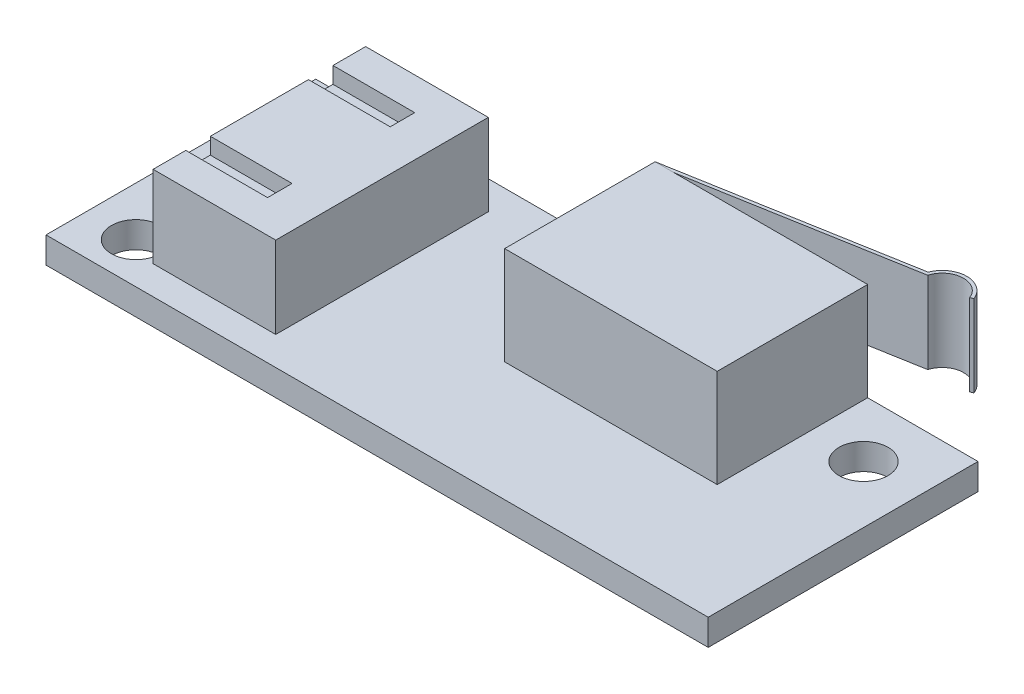
ISO-10303-21;
HEADER;
FILE_DESCRIPTION(('STEP AP214'),'2;1');
FILE_NAME('part.step','',(''),(''),'','','');
FILE_SCHEMA(('AUTOMOTIVE_DESIGN { 1 0 10303 214 1 1 1 1 }'));
ENDSEC;
DATA;
#1=APPLICATION_CONTEXT('core data for automotive mechanical design processes');
#2=APPLICATION_PROTOCOL_DEFINITION('international standard','automotive_design',2000,#1);
#3=PRODUCT_CONTEXT('',#1,'mechanical');
#4=PRODUCT('Part','Part','',(#3));
#5=PRODUCT_RELATED_PRODUCT_CATEGORY('part','',(#4));
#6=PRODUCT_DEFINITION_FORMATION('','',#4);
#7=PRODUCT_DEFINITION_CONTEXT('part definition',#1,'design');
#8=PRODUCT_DEFINITION('design','',#6,#7);
#9=PRODUCT_DEFINITION_SHAPE('','',#8);
#10=(LENGTH_UNIT() NAMED_UNIT(*) SI_UNIT(.MILLI.,.METRE.));
#11=(NAMED_UNIT(*) PLANE_ANGLE_UNIT() SI_UNIT($,.RADIAN.));
#12=(NAMED_UNIT(*) SI_UNIT($,.STERADIAN.) SOLID_ANGLE_UNIT());
#13=UNCERTAINTY_MEASURE_WITH_UNIT(LENGTH_MEASURE(1.E-05),#10,'distance_accuracy_value','');
#14=(GEOMETRIC_REPRESENTATION_CONTEXT(3) GLOBAL_UNCERTAINTY_ASSIGNED_CONTEXT((#13)) GLOBAL_UNIT_ASSIGNED_CONTEXT((#10,
#11,#12)) REPRESENTATION_CONTEXT('',''));
#15=CARTESIAN_POINT('',(0.,0.,0.));
#16=DIRECTION('',(0.,0.,1.));
#17=DIRECTION('',(1.,0.,0.));
#18=AXIS2_PLACEMENT_3D('',#15,#16,#17);
#19=CARTESIAN_POINT('',(16.1,2.6,-10.2153266453467));
#20=DIRECTION('',(0.,1.,0.));
#21=DIRECTION('',(0.,0.,1.));
#22=AXIS2_PLACEMENT_3D('',#19,#20,#21);
#23=CYLINDRICAL_SURFACE('',#22,1.3);
#24=CARTESIAN_POINT('',(16.1,7.6,-10.2153266453467));
#25=DIRECTION('',(0.,1.,0.));
#26=DIRECTION('',(1.,0.,0.));
#27=AXIS2_PLACEMENT_3D('',#24,#25,#26);
#28=CIRCLE('',#27,1.3);
#29=CARTESIAN_POINT('',(14.8514582290492,7.6,-10.5774639759146));
#30=VERTEX_POINT('',#29);
#31=CARTESIAN_POINT('',(17.3133333333333,7.6,-10.6820409286316));
#32=VERTEX_POINT('',#31);
#33=EDGE_CURVE('E126',#30,#32,#28,.F.);
#34=ORIENTED_EDGE('',*,*,#33,.F.);
#35=DIRECTION('',(0.,1.,0.));
#36=VECTOR('',#35,1.);
#37=CARTESIAN_POINT('',(14.8514582290492,2.6,-10.5774639759146));
#38=LINE('',#37,#36);
#39=CARTESIAN_POINT('',(14.8514582290492,2.6,-10.5774639759146));
#40=VERTEX_POINT('',#39);
#41=EDGE_CURVE('E12',#40,#30,#38,.T.);
#42=ORIENTED_EDGE('',*,*,#41,.F.);
#43=CARTESIAN_POINT('',(16.1,2.6,-10.2153266453467));
#44=DIRECTION('',(0.,1.,0.));
#45=DIRECTION('',(1.,0.,0.));
#46=AXIS2_PLACEMENT_3D('',#43,#44,#45);
#47=CIRCLE('',#46,1.3);
#48=CARTESIAN_POINT('',(17.3133333333333,2.6,-10.6820409286316));
#49=VERTEX_POINT('',#48);
#50=EDGE_CURVE('E139',#40,#49,#47,.F.);
#51=ORIENTED_EDGE('',*,*,#50,.T.);
#52=DIRECTION('',(0.,1.,0.));
#53=VECTOR('',#52,1.);
#54=CARTESIAN_POINT('',(17.3133333333333,2.6,-10.6820409286316));
#55=LINE('',#54,#53);
#56=EDGE_CURVE('E47',#49,#32,#55,.T.);
#57=ORIENTED_EDGE('',*,*,#56,.T.);
#58=EDGE_LOOP('',(#34,#42,#51,#57));
#59=FACE_BOUND('',#58,.T.);
#60=ADVANCED_FACE('F44',(#59),#23,.F.);
#61=CARTESIAN_POINT('',(0.534729635533386,2.6,-8.05303844939756));
#62=DIRECTION('',(0.173648177666924,0.,0.984807753012209));
#63=DIRECTION('',(0.984807753012209,0.,-0.173648177666924));
#64=AXIS2_PLACEMENT_3D('',#61,#62,#63);
#65=PLANE('',#64);
#66=DIRECTION('',(0.984807753012209,0.,-0.173648177666924));
#67=VECTOR('',#66,1.);
#68=CARTESIAN_POINT('',(0.534729635533386,7.6,-8.05303844939756));
#69=LINE('',#68,#67);
#70=CARTESIAN_POINT('',(0.534729635533386,7.6,-8.05303844939756));
#71=VERTEX_POINT('',#70);
#72=EDGE_CURVE('E137',#71,#30,#69,.T.);
#73=ORIENTED_EDGE('',*,*,#72,.F.);
#74=DIRECTION('',(0.,1.,0.));
#75=VECTOR('',#74,1.);
#76=CARTESIAN_POINT('',(0.534729635533386,2.6,-8.05303844939756));
#77=LINE('',#76,#75);
#78=CARTESIAN_POINT('',(0.534729635533386,2.6,-8.05303844939756));
#79=VERTEX_POINT('',#78);
#80=EDGE_CURVE('E53',#79,#71,#77,.T.);
#81=ORIENTED_EDGE('',*,*,#80,.F.);
#82=DIRECTION('',(0.984807753012209,0.,-0.173648177666924));
#83=VECTOR('',#82,1.);
#84=CARTESIAN_POINT('',(0.534729635533386,2.6,-8.05303844939756));
#85=LINE('',#84,#83);
#86=EDGE_CURVE('E107',#79,#40,#85,.T.);
#87=ORIENTED_EDGE('',*,*,#86,.T.);
#88=ORIENTED_EDGE('',*,*,#41,.T.);
#89=EDGE_LOOP('',(#73,#81,#87,#88));
#90=FACE_BOUND('',#89,.T.);
#91=ADVANCED_FACE('F151',(#90),#65,.T.);
#92=CARTESIAN_POINT('',(0.534729635533386,2.6,-8.05303844939756));
#93=DIRECTION('',(0.984807753012209,0.,-0.173648177666924));
#94=DIRECTION('',(-0.173648177666924,0.,-0.984807753012209));
#95=AXIS2_PLACEMENT_3D('',#92,#93,#94);
#96=PLANE('',#95);
#97=DIRECTION('',(-0.173648177666924,0.,-0.984807753012209));
#98=VECTOR('',#97,1.);
#99=CARTESIAN_POINT('',(0.534729635533386,7.6,-8.05303844939756));
#100=LINE('',#99,#98);
#101=CARTESIAN_POINT('',(0.500000000000001,7.6,-8.25));
#102=VERTEX_POINT('',#101);
#103=EDGE_CURVE('E112',#71,#102,#100,.T.);
#104=ORIENTED_EDGE('',*,*,#103,.T.);
#105=DIRECTION('',(0.,1.,0.));
#106=VECTOR('',#105,1.);
#107=CARTESIAN_POINT('',(0.500000000000001,2.6,-8.25));
#108=LINE('',#107,#106);
#109=CARTESIAN_POINT('',(0.500000000000001,2.6,-8.25));
#110=VERTEX_POINT('',#109);
#111=EDGE_CURVE('E110',#110,#102,#108,.T.);
#112=ORIENTED_EDGE('',*,*,#111,.F.);
#113=DIRECTION('',(-0.173648177666924,0.,-0.984807753012209));
#114=VECTOR('',#113,1.);
#115=CARTESIAN_POINT('',(0.534729635533386,2.6,-8.05303844939756));
#116=LINE('',#115,#114);
#117=EDGE_CURVE('E101',#79,#110,#116,.T.);
#118=ORIENTED_EDGE('',*,*,#117,.F.);
#119=ORIENTED_EDGE('',*,*,#80,.T.);
#120=EDGE_LOOP('',(#104,#112,#118,#119));
#121=FACE_BOUND('',#120,.T.);
#122=ADVANCED_FACE('F111',(#121),#96,.F.);
#123=CARTESIAN_POINT('',(0.500000000000001,2.6,-8.25));
#124=DIRECTION('',(0.173648177666924,0.,0.984807753012209));
#125=DIRECTION('',(0.984807753012209,0.,-0.173648177666924));
#126=AXIS2_PLACEMENT_3D('',#123,#124,#125);
#127=PLANE('',#126);
#128=DIRECTION('',(0.984807753012209,0.,-0.173648177666924));
#129=VECTOR('',#128,1.);
#130=CARTESIAN_POINT('',(0.500000000000001,7.6,-8.25));
#131=LINE('',#130,#129);
#132=CARTESIAN_POINT('',(14.7,7.6,-10.7538431260601));
#133=VERTEX_POINT('',#132);
#134=EDGE_CURVE('E134',#102,#133,#131,.T.);
#135=ORIENTED_EDGE('',*,*,#134,.T.);
#136=DIRECTION('',(0.,1.,0.));
#137=VECTOR('',#136,1.);
#138=CARTESIAN_POINT('',(14.7,2.6,-10.7538431260601));
#139=LINE('',#138,#137);
#140=CARTESIAN_POINT('',(14.7,2.6,-10.7538431260601));
#141=VERTEX_POINT('',#140);
#142=EDGE_CURVE('E115',#141,#133,#139,.T.);
#143=ORIENTED_EDGE('',*,*,#142,.F.);
#144=DIRECTION('',(0.984807753012209,0.,-0.173648177666924));
#145=VECTOR('',#144,1.);
#146=CARTESIAN_POINT('',(0.500000000000001,2.6,-8.25));
#147=LINE('',#146,#145);
#148=EDGE_CURVE('E105',#110,#141,#147,.T.);
#149=ORIENTED_EDGE('',*,*,#148,.F.);
#150=ORIENTED_EDGE('',*,*,#111,.T.);
#151=EDGE_LOOP('',(#135,#143,#149,#150));
#152=FACE_BOUND('',#151,.T.);
#153=ADVANCED_FACE('F117',(#152),#127,.F.);
#154=CARTESIAN_POINT('',(16.1,2.6,-10.2153266453467));
#155=DIRECTION('',(0.,1.,0.));
#156=DIRECTION('',(0.,0.,1.));
#157=AXIS2_PLACEMENT_3D('',#154,#155,#156);
#158=CYLINDRICAL_SURFACE('',#157,1.5);
#159=CARTESIAN_POINT('',(16.1,7.6,-10.2153266453467));
#160=DIRECTION('',(0.,-1.,0.));
#161=DIRECTION('',(0.,0.,-1.));
#162=AXIS2_PLACEMENT_3D('',#159,#160,#161);
#163=CIRCLE('',#162,1.5);
#164=CARTESIAN_POINT('',(17.5,7.6,-10.7538431260601));
#165=VERTEX_POINT('',#164);
#166=EDGE_CURVE('E132',#133,#165,#163,.T.);
#167=ORIENTED_EDGE('',*,*,#166,.T.);
#168=DIRECTION('',(0.,1.,0.));
#169=VECTOR('',#168,1.);
#170=CARTESIAN_POINT('',(17.5,2.6,-10.7538431260601));
#171=LINE('',#170,#169);
#172=CARTESIAN_POINT('',(17.5,2.6,-10.7538431260601));
#173=VERTEX_POINT('',#172);
#174=EDGE_CURVE('E142',#173,#165,#171,.T.);
#175=ORIENTED_EDGE('',*,*,#174,.F.);
#176=CARTESIAN_POINT('',(16.1,2.6,-10.2153266453467));
#177=DIRECTION('',(0.,-1.,0.));
#178=DIRECTION('',(0.,0.,-1.));
#179=AXIS2_PLACEMENT_3D('',#176,#177,#178);
#180=CIRCLE('',#179,1.5);
#181=EDGE_CURVE('E120',#141,#173,#180,.T.);
#182=ORIENTED_EDGE('',*,*,#181,.F.);
#183=ORIENTED_EDGE('',*,*,#142,.T.);
#184=EDGE_LOOP('',(#167,#175,#182,#183));
#185=FACE_BOUND('',#184,.T.);
#186=ADVANCED_FACE('F164',(#185),#158,.T.);
#187=CARTESIAN_POINT('',(17.5,2.6,-10.7538431260601));
#188=DIRECTION('',(-0.359010987142303,0.,-0.933333333333332));
#189=DIRECTION('',(-0.933333333333332,0.,0.359010987142303));
#190=AXIS2_PLACEMENT_3D('',#187,#188,#189);
#191=PLANE('',#190);
#192=DIRECTION('',(-0.933333333333332,0.,0.359010987142303));
#193=VECTOR('',#192,1.);
#194=CARTESIAN_POINT('',(17.5,7.6,-10.7538431260601));
#195=LINE('',#194,#193);
#196=EDGE_CURVE('E129',#165,#32,#195,.T.);
#197=ORIENTED_EDGE('',*,*,#196,.T.);
#198=ORIENTED_EDGE('',*,*,#56,.F.);
#199=DIRECTION('',(-0.933333333333332,0.,0.359010987142303));
#200=VECTOR('',#199,1.);
#201=CARTESIAN_POINT('',(17.5,2.6,-10.7538431260601));
#202=LINE('',#201,#200);
#203=EDGE_CURVE('E93',#173,#49,#202,.T.);
#204=ORIENTED_EDGE('',*,*,#203,.F.);
#205=ORIENTED_EDGE('',*,*,#174,.T.);
#206=EDGE_LOOP('',(#197,#198,#204,#205));
#207=FACE_BOUND('',#206,.T.);
#208=ADVANCED_FACE('F147',(#207),#191,.F.);
#209=CARTESIAN_POINT('',(16.1,2.6,-10.2153266453467));
#210=DIRECTION('',(0.,1.,0.));
#211=DIRECTION('',(1.,0.,0.));
#212=AXIS2_PLACEMENT_3D('',#209,#210,#211);
#213=PLANE('',#212);
#214=ORIENTED_EDGE('',*,*,#50,.F.);
#215=ORIENTED_EDGE('',*,*,#86,.F.);
#216=ORIENTED_EDGE('',*,*,#117,.T.);
#217=ORIENTED_EDGE('',*,*,#148,.T.);
#218=ORIENTED_EDGE('',*,*,#181,.T.);
#219=ORIENTED_EDGE('',*,*,#203,.T.);
#220=EDGE_LOOP('',(#214,#215,#216,#217,#218,#219));
#221=FACE_BOUND('',#220,.T.);
#222=ADVANCED_FACE('F103',(#221),#213,.F.);
#223=CARTESIAN_POINT('',(16.1,7.6,-10.2153266453467));
#224=DIRECTION('',(0.,1.,0.));
#225=DIRECTION('',(1.,0.,0.));
#226=AXIS2_PLACEMENT_3D('',#223,#224,#225);
#227=PLANE('',#226);
#228=ORIENTED_EDGE('',*,*,#33,.T.);
#229=ORIENTED_EDGE('',*,*,#196,.F.);
#230=ORIENTED_EDGE('',*,*,#166,.F.);
#231=ORIENTED_EDGE('',*,*,#134,.F.);
#232=ORIENTED_EDGE('',*,*,#103,.F.);
#233=ORIENTED_EDGE('',*,*,#72,.T.);
#234=EDGE_LOOP('',(#228,#229,#230,#231,#232,#233));
#235=FACE_BOUND('',#234,.T.);
#236=ADVANCED_FACE('F150',(#235),#227,.T.);
#237=CLOSED_SHELL('',(#60,#91,#122,#153,#186,#208,#222,#236));
#238=MANIFOLD_SOLID_BREP('B2',#237);
#239=CARTESIAN_POINT('',(-7.95000000000001,6.6,-6.5));
#240=DIRECTION('',(-1.,0.,0.));
#241=DIRECTION('',(0.,0.,1.));
#242=AXIS2_PLACEMENT_3D('',#239,#240,#241);
#243=PLANE('',#242);
#244=DIRECTION('',(0.,0.,-1.));
#245=VECTOR('',#244,1.);
#246=CARTESIAN_POINT('',(-7.95000000000001,1.6,-6.5));
#247=LINE('',#246,#245);
#248=CARTESIAN_POINT('',(-7.95,1.6,6.5));
#249=VERTEX_POINT('',#248);
#250=CARTESIAN_POINT('',(-7.95000000000001,1.6,-6.5));
#251=VERTEX_POINT('',#250);
#252=EDGE_CURVE('E376',#249,#251,#247,.T.);
#253=ORIENTED_EDGE('',*,*,#252,.T.);
#254=DIRECTION('',(0.,-1.,0.));
#255=VECTOR('',#254,1.);
#256=CARTESIAN_POINT('',(-7.95000000000001,6.6,-6.5));
#257=LINE('',#256,#255);
#258=CARTESIAN_POINT('',(-7.95000000000001,6.6,-6.5));
#259=VERTEX_POINT('',#258);
#260=EDGE_CURVE('E42',#259,#251,#257,.T.);
#261=ORIENTED_EDGE('',*,*,#260,.F.);
#262=DIRECTION('',(0.,0.,-1.));
#263=VECTOR('',#262,1.);
#264=CARTESIAN_POINT('',(-7.95000000000001,6.6,-6.5));
#265=LINE('',#264,#263);
#266=CARTESIAN_POINT('',(-7.95,6.6,6.5));
#267=VERTEX_POINT('',#266);
#268=EDGE_CURVE('E382',#267,#259,#265,.T.);
#269=ORIENTED_EDGE('',*,*,#268,.F.);
#270=DIRECTION('',(0.,-1.,0.));
#271=VECTOR('',#270,1.);
#272=CARTESIAN_POINT('',(-7.95,6.6,6.5));
#273=LINE('',#272,#271);
#274=EDGE_CURVE('E395',#267,#249,#273,.T.);
#275=ORIENTED_EDGE('',*,*,#274,.T.);
#276=EDGE_LOOP('',(#253,#261,#269,#275));
#277=FACE_BOUND('',#276,.T.);
#278=ADVANCED_FACE('F230',(#277),#243,.F.);
#279=CARTESIAN_POINT('',(-15.45,6.6,-6.5));
#280=DIRECTION('',(0.,0.,1.));
#281=DIRECTION('',(1.,0.,0.));
#282=AXIS2_PLACEMENT_3D('',#279,#280,#281);
#283=PLANE('',#282);
#284=DIRECTION('',(-1.,0.,0.));
#285=VECTOR('',#284,1.);
#286=CARTESIAN_POINT('',(-15.45,1.6,-6.5));
#287=LINE('',#286,#285);
#288=CARTESIAN_POINT('',(-15.45,1.6,-6.5));
#289=VERTEX_POINT('',#288);
#290=EDGE_CURVE('E398',#251,#289,#287,.T.);
#291=ORIENTED_EDGE('',*,*,#290,.T.);
#292=DIRECTION('',(0.,-1.,0.));
#293=VECTOR('',#292,1.);
#294=CARTESIAN_POINT('',(-15.45,6.6,-6.5));
#295=LINE('',#294,#293);
#296=CARTESIAN_POINT('',(-15.45,6.6,-6.5));
#297=VERTEX_POINT('',#296);
#298=EDGE_CURVE('E237',#297,#289,#295,.T.);
#299=ORIENTED_EDGE('',*,*,#298,.F.);
#300=DIRECTION('',(-1.,0.,0.));
#301=VECTOR('',#300,1.);
#302=CARTESIAN_POINT('',(-15.45,6.6,-6.5));
#303=LINE('',#302,#301);
#304=EDGE_CURVE('E385',#259,#297,#303,.T.);
#305=ORIENTED_EDGE('',*,*,#304,.F.);
#306=ORIENTED_EDGE('',*,*,#260,.T.);
#307=EDGE_LOOP('',(#291,#299,#305,#306));
#308=FACE_BOUND('',#307,.T.);
#309=ADVANCED_FACE('F447',(#308),#283,.F.);
#310=CARTESIAN_POINT('',(-15.45,6.6,-6.5));
#311=DIRECTION('',(1.,0.,0.));
#312=DIRECTION('',(0.,0.,-1.));
#313=AXIS2_PLACEMENT_3D('',#310,#311,#312);
#314=PLANE('',#313);
#315=DIRECTION('',(0.,0.,1.));
#316=VECTOR('',#315,1.);
#317=CARTESIAN_POINT('',(-15.45,6.6,-6.5));
#318=LINE('',#317,#316);
#319=CARTESIAN_POINT('',(-15.45,6.6,4.5));
#320=VERTEX_POINT('',#319);
#321=CARTESIAN_POINT('',(-15.45,6.6,6.5));
#322=VERTEX_POINT('',#321);
#323=EDGE_CURVE('E388',#320,#322,#318,.T.);
#324=ORIENTED_EDGE('',*,*,#323,.F.);
#325=DIRECTION('',(0.,1.,0.));
#326=VECTOR('',#325,1.);
#327=CARTESIAN_POINT('',(-15.45,5.6,4.5));
#328=LINE('',#327,#326);
#329=CARTESIAN_POINT('',(-15.45,5.6,4.5));
#330=VERTEX_POINT('',#329);
#331=EDGE_CURVE('E348',#330,#320,#328,.T.);
#332=ORIENTED_EDGE('',*,*,#331,.F.);
#333=DIRECTION('',(0.,0.,1.));
#334=VECTOR('',#333,1.);
#335=CARTESIAN_POINT('',(-15.45,5.6,4.5));
#336=LINE('',#335,#334);
#337=CARTESIAN_POINT('',(-15.45,5.6,3.));
#338=VERTEX_POINT('',#337);
#339=EDGE_CURVE('E326',#338,#330,#336,.T.);
#340=ORIENTED_EDGE('',*,*,#339,.F.);
#341=DIRECTION('',(0.,1.,0.));
#342=VECTOR('',#341,1.);
#343=CARTESIAN_POINT('',(-15.45,5.6,3.));
#344=LINE('',#343,#342);
#345=CARTESIAN_POINT('',(-15.45,6.6,3.));
#346=VERTEX_POINT('',#345);
#347=EDGE_CURVE('E351',#338,#346,#344,.T.);
#348=ORIENTED_EDGE('',*,*,#347,.T.);
#349=CARTESIAN_POINT('',(-15.45,6.6,-3.));
#350=VERTEX_POINT('',#349);
#351=EDGE_CURVE('E393',#350,#346,#318,.T.);
#352=ORIENTED_EDGE('',*,*,#351,.F.);
#353=DIRECTION('',(0.,1.,0.));
#354=VECTOR('',#353,1.);
#355=CARTESIAN_POINT('',(-15.45,5.6,-3.));
#356=LINE('',#355,#354);
#357=CARTESIAN_POINT('',(-15.45,5.6,-3.));
#358=VERTEX_POINT('',#357);
#359=EDGE_CURVE('E252',#358,#350,#356,.T.);
#360=ORIENTED_EDGE('',*,*,#359,.F.);
#361=DIRECTION('',(0.,0.,1.));
#362=VECTOR('',#361,1.);
#363=CARTESIAN_POINT('',(-15.45,5.6,-4.5));
#364=LINE('',#363,#362);
#365=CARTESIAN_POINT('',(-15.45,5.6,-4.5));
#366=VERTEX_POINT('',#365);
#367=EDGE_CURVE('E355',#366,#358,#364,.T.);
#368=ORIENTED_EDGE('',*,*,#367,.F.);
#369=DIRECTION('',(0.,1.,0.));
#370=VECTOR('',#369,1.);
#371=CARTESIAN_POINT('',(-15.45,5.6,-4.5));
#372=LINE('',#371,#370);
#373=CARTESIAN_POINT('',(-15.45,6.6,-4.5));
#374=VERTEX_POINT('',#373);
#375=EDGE_CURVE('E373',#366,#374,#372,.T.);
#376=ORIENTED_EDGE('',*,*,#375,.T.);
#377=EDGE_CURVE('E389',#297,#374,#318,.T.);
#378=ORIENTED_EDGE('',*,*,#377,.F.);
#379=ORIENTED_EDGE('',*,*,#298,.T.);
#380=DIRECTION('',(0.,0.,1.));
#381=VECTOR('',#380,1.);
#382=CARTESIAN_POINT('',(-15.45,1.6,-6.5));
#383=LINE('',#382,#381);
#384=CARTESIAN_POINT('',(-15.45,1.6,6.5));
#385=VERTEX_POINT('',#384);
#386=EDGE_CURVE('E400',#289,#385,#383,.T.);
#387=ORIENTED_EDGE('',*,*,#386,.T.);
#388=DIRECTION('',(0.,-1.,0.));
#389=VECTOR('',#388,1.);
#390=CARTESIAN_POINT('',(-15.45,6.6,6.5));
#391=LINE('',#390,#389);
#392=EDGE_CURVE('E405',#322,#385,#391,.T.);
#393=ORIENTED_EDGE('',*,*,#392,.F.);
#394=EDGE_LOOP('',(#324,#332,#340,#348,#352,#360,#368,#376,#378,#379,#387,#393));
#395=FACE_BOUND('',#394,.T.);
#396=ADVANCED_FACE('F413',(#395),#314,.F.);
#397=CARTESIAN_POINT('',(-15.45,6.6,6.5));
#398=DIRECTION('',(0.,0.,-1.));
#399=DIRECTION('',(-1.,0.,0.));
#400=AXIS2_PLACEMENT_3D('',#397,#398,#399);
#401=PLANE('',#400);
#402=DIRECTION('',(1.,0.,0.));
#403=VECTOR('',#402,1.);
#404=CARTESIAN_POINT('',(-15.45,1.6,6.5));
#405=LINE('',#404,#403);
#406=EDGE_CURVE('E386',#385,#249,#405,.T.);
#407=ORIENTED_EDGE('',*,*,#406,.T.);
#408=ORIENTED_EDGE('',*,*,#274,.F.);
#409=DIRECTION('',(1.,0.,0.));
#410=VECTOR('',#409,1.);
#411=CARTESIAN_POINT('',(-15.45,6.6,6.5));
#412=LINE('',#411,#410);
#413=EDGE_CURVE('E392',#322,#267,#412,.T.);
#414=ORIENTED_EDGE('',*,*,#413,.F.);
#415=ORIENTED_EDGE('',*,*,#392,.T.);
#416=EDGE_LOOP('',(#407,#408,#414,#415));
#417=FACE_BOUND('',#416,.T.);
#418=ADVANCED_FACE('F422',(#417),#401,.F.);
#419=CARTESIAN_POINT('',(0.,6.6,0.));
#420=DIRECTION('',(0.,1.,0.));
#421=DIRECTION('',(0.,0.,1.));
#422=AXIS2_PLACEMENT_3D('',#419,#420,#421);
#423=PLANE('',#422);
#424=DIRECTION('',(1.,0.,0.));
#425=VECTOR('',#424,1.);
#426=CARTESIAN_POINT('',(-10.45,6.6,4.5));
#427=LINE('',#426,#425);
#428=CARTESIAN_POINT('',(-10.45,6.6,4.5));
#429=VERTEX_POINT('',#428);
#430=EDGE_CURVE('E244',#320,#429,#427,.T.);
#431=ORIENTED_EDGE('',*,*,#430,.F.);
#432=ORIENTED_EDGE('',*,*,#323,.T.);
#433=ORIENTED_EDGE('',*,*,#413,.T.);
#434=ORIENTED_EDGE('',*,*,#268,.T.);
#435=ORIENTED_EDGE('',*,*,#304,.T.);
#436=ORIENTED_EDGE('',*,*,#377,.T.);
#437=DIRECTION('',(-1.,0.,0.));
#438=VECTOR('',#437,1.);
#439=CARTESIAN_POINT('',(-10.45,6.6,-4.5));
#440=LINE('',#439,#438);
#441=CARTESIAN_POINT('',(-10.45,6.6,-4.5));
#442=VERTEX_POINT('',#441);
#443=EDGE_CURVE('E359',#442,#374,#440,.T.);
#444=ORIENTED_EDGE('',*,*,#443,.F.);
#445=DIRECTION('',(0.,0.,-1.));
#446=VECTOR('',#445,1.);
#447=CARTESIAN_POINT('',(-10.45,6.6,-4.5));
#448=LINE('',#447,#446);
#449=CARTESIAN_POINT('',(-10.45,6.6,-3.));
#450=VERTEX_POINT('',#449);
#451=EDGE_CURVE('E369',#450,#442,#448,.T.);
#452=ORIENTED_EDGE('',*,*,#451,.F.);
#453=DIRECTION('',(1.,0.,0.));
#454=VECTOR('',#453,1.);
#455=CARTESIAN_POINT('',(-10.45,6.6,-3.));
#456=LINE('',#455,#454);
#457=EDGE_CURVE('E350',#350,#450,#456,.T.);
#458=ORIENTED_EDGE('',*,*,#457,.F.);
#459=ORIENTED_EDGE('',*,*,#351,.T.);
#460=DIRECTION('',(-1.,0.,0.));
#461=VECTOR('',#460,1.);
#462=CARTESIAN_POINT('',(-10.45,6.6,3.));
#463=LINE('',#462,#461);
#464=CARTESIAN_POINT('',(-10.45,6.6,3.));
#465=VERTEX_POINT('',#464);
#466=EDGE_CURVE('E339',#465,#346,#463,.T.);
#467=ORIENTED_EDGE('',*,*,#466,.F.);
#468=DIRECTION('',(0.,0.,-1.));
#469=VECTOR('',#468,1.);
#470=CARTESIAN_POINT('',(-10.45,6.6,4.5));
#471=LINE('',#470,#469);
#472=EDGE_CURVE('E341',#429,#465,#471,.T.);
#473=ORIENTED_EDGE('',*,*,#472,.F.);
#474=EDGE_LOOP('',(#431,#432,#433,#434,#435,#436,#444,#452,#458,#459,#467,#473));
#475=FACE_BOUND('',#474,.T.);
#476=ADVANCED_FACE('F428',(#475),#423,.T.);
#477=CARTESIAN_POINT('',(0.,1.6,0.));
#478=DIRECTION('',(0.,1.,0.));
#479=DIRECTION('',(0.,0.,1.));
#480=AXIS2_PLACEMENT_3D('',#477,#478,#479);
#481=PLANE('',#480);
#482=ORIENTED_EDGE('',*,*,#252,.F.);
#483=ORIENTED_EDGE('',*,*,#406,.F.);
#484=ORIENTED_EDGE('',*,*,#386,.F.);
#485=ORIENTED_EDGE('',*,*,#290,.F.);
#486=EDGE_LOOP('',(#482,#483,#484,#485));
#487=FACE_BOUND('',#486,.T.);
#488=ADVANCED_FACE('F419',(#487),#481,.F.);
#489=CARTESIAN_POINT('',(-10.45,5.6,-4.5));
#490=DIRECTION('',(0.,0.,-1.));
#491=DIRECTION('',(-1.,0.,0.));
#492=AXIS2_PLACEMENT_3D('',#489,#490,#491);
#493=PLANE('',#492);
#494=ORIENTED_EDGE('',*,*,#443,.T.);
#495=ORIENTED_EDGE('',*,*,#375,.F.);
#496=DIRECTION('',(-1.,0.,0.));
#497=VECTOR('',#496,1.);
#498=CARTESIAN_POINT('',(-10.45,5.6,-4.5));
#499=LINE('',#498,#497);
#500=CARTESIAN_POINT('',(-10.45,5.6,-4.5));
#501=VERTEX_POINT('',#500);
#502=EDGE_CURVE('E365',#501,#366,#499,.T.);
#503=ORIENTED_EDGE('',*,*,#502,.F.);
#504=DIRECTION('',(0.,1.,0.));
#505=VECTOR('',#504,1.);
#506=CARTESIAN_POINT('',(-10.45,5.6,-4.5));
#507=LINE('',#506,#505);
#508=EDGE_CURVE('E377',#501,#442,#507,.T.);
#509=ORIENTED_EDGE('',*,*,#508,.T.);
#510=EDGE_LOOP('',(#494,#495,#503,#509));
#511=FACE_BOUND('',#510,.T.);
#512=ADVANCED_FACE('F460',(#511),#493,.F.);
#513=CARTESIAN_POINT('',(-10.45,5.6,-4.5));
#514=DIRECTION('',(1.,0.,0.));
#515=DIRECTION('',(0.,0.,-1.));
#516=AXIS2_PLACEMENT_3D('',#513,#514,#515);
#517=PLANE('',#516);
#518=ORIENTED_EDGE('',*,*,#451,.T.);
#519=ORIENTED_EDGE('',*,*,#508,.F.);
#520=DIRECTION('',(0.,0.,-1.));
#521=VECTOR('',#520,1.);
#522=CARTESIAN_POINT('',(-10.45,5.6,-4.5));
#523=LINE('',#522,#521);
#524=CARTESIAN_POINT('',(-10.45,5.6,-3.));
#525=VERTEX_POINT('',#524);
#526=EDGE_CURVE('E362',#525,#501,#523,.T.);
#527=ORIENTED_EDGE('',*,*,#526,.F.);
#528=DIRECTION('',(0.,1.,0.));
#529=VECTOR('',#528,1.);
#530=CARTESIAN_POINT('',(-10.45,5.6,-3.));
#531=LINE('',#530,#529);
#532=EDGE_CURVE('E379',#525,#450,#531,.T.);
#533=ORIENTED_EDGE('',*,*,#532,.T.);
#534=EDGE_LOOP('',(#518,#519,#527,#533));
#535=FACE_BOUND('',#534,.T.);
#536=ADVANCED_FACE('F466',(#535),#517,.F.);
#537=CARTESIAN_POINT('',(-10.45,5.6,-3.));
#538=DIRECTION('',(0.,0.,1.));
#539=DIRECTION('',(1.,0.,0.));
#540=AXIS2_PLACEMENT_3D('',#537,#538,#539);
#541=PLANE('',#540);
#542=ORIENTED_EDGE('',*,*,#457,.T.);
#543=ORIENTED_EDGE('',*,*,#532,.F.);
#544=DIRECTION('',(1.,0.,0.));
#545=VECTOR('',#544,1.);
#546=CARTESIAN_POINT('',(-10.45,5.6,-3.));
#547=LINE('',#546,#545);
#548=EDGE_CURVE('E358',#358,#525,#547,.T.);
#549=ORIENTED_EDGE('',*,*,#548,.F.);
#550=ORIENTED_EDGE('',*,*,#359,.T.);
#551=EDGE_LOOP('',(#542,#543,#549,#550));
#552=FACE_BOUND('',#551,.T.);
#553=ADVANCED_FACE('F463',(#552),#541,.F.);
#554=CARTESIAN_POINT('',(0.,5.6,0.));
#555=DIRECTION('',(0.,-1.,0.));
#556=DIRECTION('',(0.,0.,-1.));
#557=AXIS2_PLACEMENT_3D('',#554,#555,#556);
#558=PLANE('',#557);
#559=ORIENTED_EDGE('',*,*,#367,.T.);
#560=ORIENTED_EDGE('',*,*,#548,.T.);
#561=ORIENTED_EDGE('',*,*,#526,.T.);
#562=ORIENTED_EDGE('',*,*,#502,.T.);
#563=EDGE_LOOP('',(#559,#560,#561,#562));
#564=FACE_BOUND('',#563,.T.);
#565=ADVANCED_FACE('F443',(#564),#558,.F.);
#566=CARTESIAN_POINT('',(-10.45,5.6,4.5));
#567=DIRECTION('',(0.,0.,1.));
#568=DIRECTION('',(1.,0.,0.));
#569=AXIS2_PLACEMENT_3D('',#566,#567,#568);
#570=PLANE('',#569);
#571=ORIENTED_EDGE('',*,*,#430,.T.);
#572=DIRECTION('',(0.,1.,0.));
#573=VECTOR('',#572,1.);
#574=CARTESIAN_POINT('',(-10.45,5.6,4.5));
#575=LINE('',#574,#573);
#576=CARTESIAN_POINT('',(-10.45,5.6,4.5));
#577=VERTEX_POINT('',#576);
#578=EDGE_CURVE('E316',#577,#429,#575,.T.);
#579=ORIENTED_EDGE('',*,*,#578,.F.);
#580=DIRECTION('',(1.,0.,0.));
#581=VECTOR('',#580,1.);
#582=CARTESIAN_POINT('',(-10.45,5.6,4.5));
#583=LINE('',#582,#581);
#584=EDGE_CURVE('E320',#330,#577,#583,.T.);
#585=ORIENTED_EDGE('',*,*,#584,.F.);
#586=ORIENTED_EDGE('',*,*,#331,.T.);
#587=EDGE_LOOP('',(#571,#579,#585,#586));
#588=FACE_BOUND('',#587,.T.);
#589=ADVANCED_FACE('F318',(#588),#570,.F.);
#590=CARTESIAN_POINT('',(-10.45,5.6,3.));
#591=DIRECTION('',(0.,0.,-1.));
#592=DIRECTION('',(-1.,0.,0.));
#593=AXIS2_PLACEMENT_3D('',#590,#591,#592);
#594=PLANE('',#593);
#595=ORIENTED_EDGE('',*,*,#466,.T.);
#596=ORIENTED_EDGE('',*,*,#347,.F.);
#597=DIRECTION('',(-1.,0.,0.));
#598=VECTOR('',#597,1.);
#599=CARTESIAN_POINT('',(-10.45,5.6,3.));
#600=LINE('',#599,#598);
#601=CARTESIAN_POINT('',(-10.45,5.6,3.));
#602=VERTEX_POINT('',#601);
#603=EDGE_CURVE('E334',#602,#338,#600,.T.);
#604=ORIENTED_EDGE('',*,*,#603,.F.);
#605=DIRECTION('',(0.,1.,0.));
#606=VECTOR('',#605,1.);
#607=CARTESIAN_POINT('',(-10.45,5.6,3.));
#608=LINE('',#607,#606);
#609=EDGE_CURVE('E325',#602,#465,#608,.T.);
#610=ORIENTED_EDGE('',*,*,#609,.T.);
#611=EDGE_LOOP('',(#595,#596,#604,#610));
#612=FACE_BOUND('',#611,.T.);
#613=ADVANCED_FACE('F435',(#612),#594,.F.);
#614=CARTESIAN_POINT('',(-10.45,5.6,4.5));
#615=DIRECTION('',(1.,0.,0.));
#616=DIRECTION('',(0.,0.,-1.));
#617=AXIS2_PLACEMENT_3D('',#614,#615,#616);
#618=PLANE('',#617);
#619=ORIENTED_EDGE('',*,*,#472,.T.);
#620=ORIENTED_EDGE('',*,*,#609,.F.);
#621=DIRECTION('',(0.,0.,-1.));
#622=VECTOR('',#621,1.);
#623=CARTESIAN_POINT('',(-10.45,5.6,4.5));
#624=LINE('',#623,#622);
#625=EDGE_CURVE('E329',#577,#602,#624,.T.);
#626=ORIENTED_EDGE('',*,*,#625,.F.);
#627=ORIENTED_EDGE('',*,*,#578,.T.);
#628=EDGE_LOOP('',(#619,#620,#626,#627));
#629=FACE_BOUND('',#628,.T.);
#630=ADVANCED_FACE('F330',(#629),#618,.F.);
#631=CARTESIAN_POINT('',(0.,5.6,0.));
#632=DIRECTION('',(0.,-1.,0.));
#633=DIRECTION('',(0.,0.,-1.));
#634=AXIS2_PLACEMENT_3D('',#631,#632,#633);
#635=PLANE('',#634);
#636=ORIENTED_EDGE('',*,*,#584,.T.);
#637=ORIENTED_EDGE('',*,*,#625,.T.);
#638=ORIENTED_EDGE('',*,*,#603,.T.);
#639=ORIENTED_EDGE('',*,*,#339,.T.);
#640=EDGE_LOOP('',(#636,#637,#638,#639));
#641=FACE_BOUND('',#640,.T.);
#642=ADVANCED_FACE('F336',(#641),#635,.F.);
#643=CLOSED_SHELL('',(#278,#309,#396,#418,#476,#488,#512,#536,#553,#565,#589,#613,#630,#642));
#644=MANIFOLD_SOLID_BREP('B6',#643);
#645=CARTESIAN_POINT('',(13.5,7.6,-8.25));
#646=DIRECTION('',(-1.,0.,0.));
#647=DIRECTION('',(0.,0.,1.));
#648=AXIS2_PLACEMENT_3D('',#645,#646,#647);
#649=PLANE('',#648);
#650=DIRECTION('',(0.,0.,-1.));
#651=VECTOR('',#650,1.);
#652=CARTESIAN_POINT('',(13.5,1.6,-8.25));
#653=LINE('',#652,#651);
#654=CARTESIAN_POINT('',(13.5,1.6,0.950000000000001));
#655=VERTEX_POINT('',#654);
#656=CARTESIAN_POINT('',(13.5,1.6,-8.25));
#657=VERTEX_POINT('',#656);
#658=EDGE_CURVE('E632',#655,#657,#653,.T.);
#659=ORIENTED_EDGE('',*,*,#658,.T.);
#660=DIRECTION('',(0.,-1.,0.));
#661=VECTOR('',#660,1.);
#662=CARTESIAN_POINT('',(13.5,7.6,-8.25));
#663=LINE('',#662,#661);
#664=CARTESIAN_POINT('',(13.5,7.6,-8.25));
#665=VERTEX_POINT('',#664);
#666=EDGE_CURVE('E228',#665,#657,#663,.T.);
#667=ORIENTED_EDGE('',*,*,#666,.F.);
#668=DIRECTION('',(0.,0.,-1.));
#669=VECTOR('',#668,1.);
#670=CARTESIAN_POINT('',(13.5,7.6,-8.25));
#671=LINE('',#670,#669);
#672=CARTESIAN_POINT('',(13.5,7.6,0.950000000000001));
#673=VERTEX_POINT('',#672);
#674=EDGE_CURVE('E620',#673,#665,#671,.T.);
#675=ORIENTED_EDGE('',*,*,#674,.F.);
#676=DIRECTION('',(0.,-1.,0.));
#677=VECTOR('',#676,1.);
#678=CARTESIAN_POINT('',(13.5,7.6,0.950000000000001));
#679=LINE('',#678,#677);
#680=EDGE_CURVE('E628',#673,#655,#679,.T.);
#681=ORIENTED_EDGE('',*,*,#680,.T.);
#682=EDGE_LOOP('',(#659,#667,#675,#681));
#683=FACE_BOUND('',#682,.T.);
#684=ADVANCED_FACE('F569',(#683),#649,.F.);
#685=CARTESIAN_POINT('',(0.500000000000001,7.6,-8.25));
#686=DIRECTION('',(0.,0.,1.));
#687=DIRECTION('',(1.,0.,0.));
#688=AXIS2_PLACEMENT_3D('',#685,#686,#687);
#689=PLANE('',#688);
#690=DIRECTION('',(-1.,0.,0.));
#691=VECTOR('',#690,1.);
#692=CARTESIAN_POINT('',(0.500000000000001,1.6,-8.25));
#693=LINE('',#692,#691);
#694=CARTESIAN_POINT('',(0.500000000000001,1.6,-8.25));
#695=VERTEX_POINT('',#694);
#696=EDGE_CURVE('E624',#657,#695,#693,.T.);
#697=ORIENTED_EDGE('',*,*,#696,.T.);
#698=DIRECTION('',(0.,-1.,0.));
#699=VECTOR('',#698,1.);
#700=CARTESIAN_POINT('',(0.500000000000001,7.6,-8.25));
#701=LINE('',#700,#699);
#702=CARTESIAN_POINT('',(0.500000000000001,7.6,-8.25));
#703=VERTEX_POINT('',#702);
#704=EDGE_CURVE('E577',#703,#695,#701,.T.);
#705=ORIENTED_EDGE('',*,*,#704,.F.);
#706=DIRECTION('',(-1.,0.,0.));
#707=VECTOR('',#706,1.);
#708=CARTESIAN_POINT('',(0.500000000000001,7.6,-8.25));
#709=LINE('',#708,#707);
#710=EDGE_CURVE('E615',#665,#703,#709,.T.);
#711=ORIENTED_EDGE('',*,*,#710,.F.);
#712=ORIENTED_EDGE('',*,*,#666,.T.);
#713=EDGE_LOOP('',(#697,#705,#711,#712));
#714=FACE_BOUND('',#713,.T.);
#715=ADVANCED_FACE('F623',(#714),#689,.F.);
#716=CARTESIAN_POINT('',(0.500000000000001,7.6,-8.25));
#717=DIRECTION('',(1.,0.,0.));
#718=DIRECTION('',(0.,0.,-1.));
#719=AXIS2_PLACEMENT_3D('',#716,#717,#718);
#720=PLANE('',#719);
#721=DIRECTION('',(0.,0.,1.));
#722=VECTOR('',#721,1.);
#723=CARTESIAN_POINT('',(0.500000000000001,1.6,-8.25));
#724=LINE('',#723,#722);
#725=CARTESIAN_POINT('',(0.500000000000002,1.6,0.950000000000001));
#726=VERTEX_POINT('',#725);
#727=EDGE_CURVE('E602',#695,#726,#724,.T.);
#728=ORIENTED_EDGE('',*,*,#727,.T.);
#729=DIRECTION('',(0.,-1.,0.));
#730=VECTOR('',#729,1.);
#731=CARTESIAN_POINT('',(0.500000000000002,7.6,0.950000000000001));
#732=LINE('',#731,#730);
#733=CARTESIAN_POINT('',(0.500000000000002,7.6,0.950000000000001));
#734=VERTEX_POINT('',#733);
#735=EDGE_CURVE('E625',#734,#726,#732,.T.);
#736=ORIENTED_EDGE('',*,*,#735,.F.);
#737=DIRECTION('',(0.,0.,1.));
#738=VECTOR('',#737,1.);
#739=CARTESIAN_POINT('',(0.500000000000001,7.6,-8.25));
#740=LINE('',#739,#738);
#741=EDGE_CURVE('E618',#703,#734,#740,.T.);
#742=ORIENTED_EDGE('',*,*,#741,.F.);
#743=ORIENTED_EDGE('',*,*,#704,.T.);
#744=EDGE_LOOP('',(#728,#736,#742,#743));
#745=FACE_BOUND('',#744,.T.);
#746=ADVANCED_FACE('F626',(#745),#720,.F.);
#747=CARTESIAN_POINT('',(0.500000000000002,7.6,0.950000000000001));
#748=DIRECTION('',(0.,0.,-1.));
#749=DIRECTION('',(-1.,0.,0.));
#750=AXIS2_PLACEMENT_3D('',#747,#748,#749);
#751=PLANE('',#750);
#752=DIRECTION('',(1.,0.,0.));
#753=VECTOR('',#752,1.);
#754=CARTESIAN_POINT('',(0.500000000000002,1.6,0.950000000000001));
#755=LINE('',#754,#753);
#756=EDGE_CURVE('E608',#726,#655,#755,.T.);
#757=ORIENTED_EDGE('',*,*,#756,.T.);
#758=ORIENTED_EDGE('',*,*,#680,.F.);
#759=DIRECTION('',(1.,0.,0.));
#760=VECTOR('',#759,1.);
#761=CARTESIAN_POINT('',(0.500000000000002,7.6,0.950000000000001));
#762=LINE('',#761,#760);
#763=EDGE_CURVE('E585',#734,#673,#762,.T.);
#764=ORIENTED_EDGE('',*,*,#763,.F.);
#765=ORIENTED_EDGE('',*,*,#735,.T.);
#766=EDGE_LOOP('',(#757,#758,#764,#765));
#767=FACE_BOUND('',#766,.T.);
#768=ADVANCED_FACE('F639',(#767),#751,.F.);
#769=CARTESIAN_POINT('',(0.,7.6,0.));
#770=DIRECTION('',(0.,1.,0.));
#771=DIRECTION('',(0.,0.,1.));
#772=AXIS2_PLACEMENT_3D('',#769,#770,#771);
#773=PLANE('',#772);
#774=ORIENTED_EDGE('',*,*,#674,.T.);
#775=ORIENTED_EDGE('',*,*,#710,.T.);
#776=ORIENTED_EDGE('',*,*,#741,.T.);
#777=ORIENTED_EDGE('',*,*,#763,.T.);
#778=EDGE_LOOP('',(#774,#775,#776,#777));
#779=FACE_BOUND('',#778,.T.);
#780=ADVANCED_FACE('F616',(#779),#773,.T.);
#781=CARTESIAN_POINT('',(0.,1.6,0.));
#782=DIRECTION('',(0.,1.,0.));
#783=DIRECTION('',(0.,0.,1.));
#784=AXIS2_PLACEMENT_3D('',#781,#782,#783);
#785=PLANE('',#784);
#786=ORIENTED_EDGE('',*,*,#658,.F.);
#787=ORIENTED_EDGE('',*,*,#756,.F.);
#788=ORIENTED_EDGE('',*,*,#727,.F.);
#789=ORIENTED_EDGE('',*,*,#696,.F.);
#790=EDGE_LOOP('',(#786,#787,#788,#789));
#791=FACE_BOUND('',#790,.T.);
#792=ADVANCED_FACE('F642',(#791),#785,.F.);
#793=CLOSED_SHELL('',(#684,#715,#746,#768,#780,#792));
#794=MANIFOLD_SOLID_BREP('B36',#793);
#795=CARTESIAN_POINT('',(0.,1.6,0.));
#796=DIRECTION('',(0.,-1.,0.));
#797=DIRECTION('',(0.,0.,-1.));
#798=AXIS2_PLACEMENT_3D('',#795,#796,#797);
#799=PLANE('',#798);
#800=DIRECTION('',(0.,0.,-1.));
#801=VECTOR('',#800,1.);
#802=CARTESIAN_POINT('',(20.25,1.6,8.25));
#803=LINE('',#802,#801);
#804=CARTESIAN_POINT('',(20.25,1.6,8.25));
#805=VERTEX_POINT('',#804);
#806=CARTESIAN_POINT('',(20.25,1.6,-8.25));
#807=VERTEX_POINT('',#806);
#808=EDGE_CURVE('E745',#805,#807,#803,.T.);
#809=ORIENTED_EDGE('',*,*,#808,.T.);
#810=DIRECTION('',(-1.,0.,0.));
#811=VECTOR('',#810,1.);
#812=CARTESIAN_POINT('',(-20.25,1.6,-8.25));
#813=LINE('',#812,#811);
#814=CARTESIAN_POINT('',(-20.25,1.6,-8.25));
#815=VERTEX_POINT('',#814);
#816=EDGE_CURVE('E740',#807,#815,#813,.T.);
#817=ORIENTED_EDGE('',*,*,#816,.T.);
#818=DIRECTION('',(0.,0.,1.));
#819=VECTOR('',#818,1.);
#820=CARTESIAN_POINT('',(-20.25,1.6,8.25));
#821=LINE('',#820,#819);
#822=CARTESIAN_POINT('',(-20.25,1.6,8.25));
#823=VERTEX_POINT('',#822);
#824=EDGE_CURVE('E743',#815,#823,#821,.T.);
#825=ORIENTED_EDGE('',*,*,#824,.T.);
#826=DIRECTION('',(1.,0.,0.));
#827=VECTOR('',#826,1.);
#828=CARTESIAN_POINT('',(-20.25,1.6,8.25));
#829=LINE('',#828,#827);
#830=EDGE_CURVE('E710',#823,#805,#829,.T.);
#831=ORIENTED_EDGE('',*,*,#830,.T.);
#832=EDGE_LOOP('',(#809,#817,#825,#831));
#833=FACE_BOUND('',#832,.T.);
#834=CARTESIAN_POINT('',(-17.25,1.6,5.75));
#835=DIRECTION('',(0.,1.,0.));
#836=DIRECTION('',(0.,0.,1.));
#837=AXIS2_PLACEMENT_3D('',#834,#835,#836);
#838=CIRCLE('',#837,1.5);
#839=CARTESIAN_POINT('',(-17.25,1.6,7.25));
#840=VERTEX_POINT('',#839);
#841=EDGE_CURVE('E760',#840,#840,#838,.T.);
#842=ORIENTED_EDGE('',*,*,#841,.F.);
#843=EDGE_LOOP('',(#842));
#844=FACE_BOUND('',#843,.T.);
#845=CARTESIAN_POINT('',(-17.25,1.6,-4.75));
#846=DIRECTION('',(0.,1.,0.));
#847=DIRECTION('',(0.,0.,1.));
#848=AXIS2_PLACEMENT_3D('',#845,#846,#847);
#849=CIRCLE('',#848,1.5);
#850=CARTESIAN_POINT('',(-17.25,1.6,-3.25));
#851=VERTEX_POINT('',#850);
#852=EDGE_CURVE('E775',#851,#851,#849,.T.);
#853=ORIENTED_EDGE('',*,*,#852,.F.);
#854=EDGE_LOOP('',(#853));
#855=FACE_BOUND('',#854,.T.);
#856=CARTESIAN_POINT('',(-2.25,1.6,-4.75));
#857=DIRECTION('',(0.,1.,0.));
#858=DIRECTION('',(0.,0.,1.));
#859=AXIS2_PLACEMENT_3D('',#856,#857,#858);
#860=CIRCLE('',#859,1.5);
#861=CARTESIAN_POINT('',(-2.25,1.6,-3.25));
#862=VERTEX_POINT('',#861);
#863=EDGE_CURVE('E781',#862,#862,#860,.T.);
#864=ORIENTED_EDGE('',*,*,#863,.F.);
#865=EDGE_LOOP('',(#864));
#866=FACE_BOUND('',#865,.T.);
#867=CARTESIAN_POINT('',(16.75,1.6,-4.75));
#868=DIRECTION('',(0.,1.,0.));
#869=DIRECTION('',(0.,0.,1.));
#870=AXIS2_PLACEMENT_3D('',#867,#868,#869);
#871=CIRCLE('',#870,1.5);
#872=CARTESIAN_POINT('',(16.75,1.6,-3.25));
#873=VERTEX_POINT('',#872);
#874=EDGE_CURVE('E787',#873,#873,#871,.T.);
#875=ORIENTED_EDGE('',*,*,#874,.F.);
#876=EDGE_LOOP('',(#875));
#877=FACE_BOUND('',#876,.T.);
#878=ADVANCED_FACE('F693',(#833,#844,#855,#866,#877),#799,.F.);
#879=CARTESIAN_POINT('',(0.,0.,0.));
#880=DIRECTION('',(0.,-1.,0.));
#881=DIRECTION('',(0.,0.,-1.));
#882=AXIS2_PLACEMENT_3D('',#879,#880,#881);
#883=PLANE('',#882);
#884=CARTESIAN_POINT('',(-2.25,0.,-4.75));
#885=DIRECTION('',(0.,1.,0.));
#886=DIRECTION('',(0.,0.,1.));
#887=AXIS2_PLACEMENT_3D('',#884,#885,#886);
#888=CIRCLE('',#887,1.5);
#889=CARTESIAN_POINT('',(-2.25,0.,-3.25));
#890=VERTEX_POINT('',#889);
#891=EDGE_CURVE('E784',#890,#890,#888,.T.);
#892=ORIENTED_EDGE('',*,*,#891,.T.);
#893=EDGE_LOOP('',(#892));
#894=FACE_BOUND('',#893,.T.);
#895=CARTESIAN_POINT('',(-17.25,0.,5.75));
#896=DIRECTION('',(0.,1.,0.));
#897=DIRECTION('',(0.,0.,1.));
#898=AXIS2_PLACEMENT_3D('',#895,#896,#897);
#899=CIRCLE('',#898,1.5);
#900=CARTESIAN_POINT('',(-17.25,0.,7.25));
#901=VERTEX_POINT('',#900);
#902=EDGE_CURVE('E772',#901,#901,#899,.T.);
#903=ORIENTED_EDGE('',*,*,#902,.T.);
#904=EDGE_LOOP('',(#903));
#905=FACE_BOUND('',#904,.T.);
#906=DIRECTION('',(0.,0.,-1.));
#907=VECTOR('',#906,1.);
#908=CARTESIAN_POINT('',(20.25,0.,8.25));
#909=LINE('',#908,#907);
#910=CARTESIAN_POINT('',(20.25,0.,8.25));
#911=VERTEX_POINT('',#910);
#912=CARTESIAN_POINT('',(20.25,0.,-8.25));
#913=VERTEX_POINT('',#912);
#914=EDGE_CURVE('E757',#911,#913,#909,.T.);
#915=ORIENTED_EDGE('',*,*,#914,.F.);
#916=DIRECTION('',(1.,0.,0.));
#917=VECTOR('',#916,1.);
#918=CARTESIAN_POINT('',(-20.25,0.,8.25));
#919=LINE('',#918,#917);
#920=CARTESIAN_POINT('',(-20.25,0.,8.25));
#921=VERTEX_POINT('',#920);
#922=EDGE_CURVE('E733',#921,#911,#919,.T.);
#923=ORIENTED_EDGE('',*,*,#922,.F.);
#924=DIRECTION('',(0.,0.,1.));
#925=VECTOR('',#924,1.);
#926=CARTESIAN_POINT('',(-20.25,0.,8.25));
#927=LINE('',#926,#925);
#928=CARTESIAN_POINT('',(-20.25,0.,-8.25));
#929=VERTEX_POINT('',#928);
#930=EDGE_CURVE('E727',#929,#921,#927,.T.);
#931=ORIENTED_EDGE('',*,*,#930,.F.);
#932=DIRECTION('',(-1.,0.,0.));
#933=VECTOR('',#932,1.);
#934=CARTESIAN_POINT('',(-20.25,0.,-8.25));
#935=LINE('',#934,#933);
#936=EDGE_CURVE('E749',#913,#929,#935,.T.);
#937=ORIENTED_EDGE('',*,*,#936,.F.);
#938=EDGE_LOOP('',(#915,#923,#931,#937));
#939=FACE_BOUND('',#938,.T.);
#940=CARTESIAN_POINT('',(-17.25,0.,-4.75));
#941=DIRECTION('',(0.,1.,0.));
#942=DIRECTION('',(0.,0.,1.));
#943=AXIS2_PLACEMENT_3D('',#940,#941,#942);
#944=CIRCLE('',#943,1.5);
#945=CARTESIAN_POINT('',(-17.25,0.,-3.25));
#946=VERTEX_POINT('',#945);
#947=EDGE_CURVE('E778',#946,#946,#944,.T.);
#948=ORIENTED_EDGE('',*,*,#947,.T.);
#949=EDGE_LOOP('',(#948));
#950=FACE_BOUND('',#949,.T.);
#951=CARTESIAN_POINT('',(16.75,0.,-4.75));
#952=DIRECTION('',(0.,1.,0.));
#953=DIRECTION('',(0.,0.,1.));
#954=AXIS2_PLACEMENT_3D('',#951,#952,#953);
#955=CIRCLE('',#954,1.5);
#956=CARTESIAN_POINT('',(16.75,0.,-3.25));
#957=VERTEX_POINT('',#956);
#958=EDGE_CURVE('E790',#957,#957,#955,.T.);
#959=ORIENTED_EDGE('',*,*,#958,.T.);
#960=EDGE_LOOP('',(#959));
#961=FACE_BOUND('',#960,.T.);
#962=ADVANCED_FACE('F768',(#894,#905,#939,#950,#961),#883,.T.);
#963=CARTESIAN_POINT('',(20.25,1.6,8.25));
#964=DIRECTION('',(-1.,0.,0.));
#965=DIRECTION('',(0.,0.,1.));
#966=AXIS2_PLACEMENT_3D('',#963,#964,#965);
#967=PLANE('',#966);
#968=ORIENTED_EDGE('',*,*,#914,.T.);
#969=DIRECTION('',(0.,-1.,0.));
#970=VECTOR('',#969,1.);
#971=CARTESIAN_POINT('',(20.25,1.6,-8.25));
#972=LINE('',#971,#970);
#973=EDGE_CURVE('E567',#807,#913,#972,.T.);
#974=ORIENTED_EDGE('',*,*,#973,.F.);
#975=ORIENTED_EDGE('',*,*,#808,.F.);
#976=DIRECTION('',(0.,-1.,0.));
#977=VECTOR('',#976,1.);
#978=CARTESIAN_POINT('',(20.25,1.6,8.25));
#979=LINE('',#978,#977);
#980=EDGE_CURVE('E753',#805,#911,#979,.T.);
#981=ORIENTED_EDGE('',*,*,#980,.T.);
#982=EDGE_LOOP('',(#968,#974,#975,#981));
#983=FACE_BOUND('',#982,.T.);
#984=ADVANCED_FACE('F695',(#983),#967,.F.);
#985=CARTESIAN_POINT('',(-20.25,1.6,-8.25));
#986=DIRECTION('',(0.,0.,1.));
#987=DIRECTION('',(1.,0.,0.));
#988=AXIS2_PLACEMENT_3D('',#985,#986,#987);
#989=PLANE('',#988);
#990=ORIENTED_EDGE('',*,*,#936,.T.);
#991=DIRECTION('',(0.,-1.,0.));
#992=VECTOR('',#991,1.);
#993=CARTESIAN_POINT('',(-20.25,1.6,-8.25));
#994=LINE('',#993,#992);
#995=EDGE_CURVE('E702',#815,#929,#994,.T.);
#996=ORIENTED_EDGE('',*,*,#995,.F.);
#997=ORIENTED_EDGE('',*,*,#816,.F.);
#998=ORIENTED_EDGE('',*,*,#973,.T.);
#999=EDGE_LOOP('',(#990,#996,#997,#998));
#1000=FACE_BOUND('',#999,.T.);
#1001=ADVANCED_FACE('F748',(#1000),#989,.F.);
#1002=CARTESIAN_POINT('',(-20.25,1.6,8.25));
#1003=DIRECTION('',(1.,0.,0.));
#1004=DIRECTION('',(0.,0.,-1.));
#1005=AXIS2_PLACEMENT_3D('',#1002,#1003,#1004);
#1006=PLANE('',#1005);
#1007=ORIENTED_EDGE('',*,*,#930,.T.);
#1008=DIRECTION('',(0.,-1.,0.));
#1009=VECTOR('',#1008,1.);
#1010=CARTESIAN_POINT('',(-20.25,1.6,8.25));
#1011=LINE('',#1010,#1009);
#1012=EDGE_CURVE('E750',#823,#921,#1011,.T.);
#1013=ORIENTED_EDGE('',*,*,#1012,.F.);
#1014=ORIENTED_EDGE('',*,*,#824,.F.);
#1015=ORIENTED_EDGE('',*,*,#995,.T.);
#1016=EDGE_LOOP('',(#1007,#1013,#1014,#1015));
#1017=FACE_BOUND('',#1016,.T.);
#1018=ADVANCED_FACE('F751',(#1017),#1006,.F.);
#1019=CARTESIAN_POINT('',(-20.25,1.6,8.25));
#1020=DIRECTION('',(0.,0.,-1.));
#1021=DIRECTION('',(-1.,0.,0.));
#1022=AXIS2_PLACEMENT_3D('',#1019,#1020,#1021);
#1023=PLANE('',#1022);
#1024=ORIENTED_EDGE('',*,*,#922,.T.);
#1025=ORIENTED_EDGE('',*,*,#980,.F.);
#1026=ORIENTED_EDGE('',*,*,#830,.F.);
#1027=ORIENTED_EDGE('',*,*,#1012,.T.);
#1028=EDGE_LOOP('',(#1024,#1025,#1026,#1027));
#1029=FACE_BOUND('',#1028,.T.);
#1030=ADVANCED_FACE('F765',(#1029),#1023,.F.);
#1031=CARTESIAN_POINT('',(-17.25,1.6,5.75));
#1032=DIRECTION('',(0.,-1.,0.));
#1033=DIRECTION('',(0.,0.,-1.));
#1034=AXIS2_PLACEMENT_3D('',#1031,#1032,#1033);
#1035=CYLINDRICAL_SURFACE('',#1034,1.5);
#1036=ORIENTED_EDGE('',*,*,#841,.T.);
#1037=EDGE_LOOP('',(#1036));
#1038=FACE_BOUND('',#1037,.T.);
#1039=ORIENTED_EDGE('',*,*,#902,.F.);
#1040=EDGE_LOOP('',(#1039));
#1041=FACE_BOUND('',#1040,.T.);
#1042=ADVANCED_FACE('F807',(#1038,#1041),#1035,.F.);
#1043=CARTESIAN_POINT('',(-17.25,1.6,-4.75));
#1044=DIRECTION('',(0.,-1.,0.));
#1045=DIRECTION('',(0.,0.,-1.));
#1046=AXIS2_PLACEMENT_3D('',#1043,#1044,#1045);
#1047=CYLINDRICAL_SURFACE('',#1046,1.5);
#1048=ORIENTED_EDGE('',*,*,#852,.T.);
#1049=EDGE_LOOP('',(#1048));
#1050=FACE_BOUND('',#1049,.T.);
#1051=ORIENTED_EDGE('',*,*,#947,.F.);
#1052=EDGE_LOOP('',(#1051));
#1053=FACE_BOUND('',#1052,.T.);
#1054=ADVANCED_FACE('F853',(#1050,#1053),#1047,.F.);
#1055=CARTESIAN_POINT('',(-2.25,1.6,-4.75));
#1056=DIRECTION('',(0.,-1.,0.));
#1057=DIRECTION('',(0.,0.,-1.));
#1058=AXIS2_PLACEMENT_3D('',#1055,#1056,#1057);
#1059=CYLINDRICAL_SURFACE('',#1058,1.5);
#1060=ORIENTED_EDGE('',*,*,#863,.T.);
#1061=EDGE_LOOP('',(#1060));
#1062=FACE_BOUND('',#1061,.T.);
#1063=ORIENTED_EDGE('',*,*,#891,.F.);
#1064=EDGE_LOOP('',(#1063));
#1065=FACE_BOUND('',#1064,.T.);
#1066=ADVANCED_FACE('F861',(#1062,#1065),#1059,.F.);
#1067=CARTESIAN_POINT('',(16.75,1.6,-4.75));
#1068=DIRECTION('',(0.,-1.,0.));
#1069=DIRECTION('',(0.,0.,-1.));
#1070=AXIS2_PLACEMENT_3D('',#1067,#1068,#1069);
#1071=CYLINDRICAL_SURFACE('',#1070,1.5);
#1072=ORIENTED_EDGE('',*,*,#874,.T.);
#1073=EDGE_LOOP('',(#1072));
#1074=FACE_BOUND('',#1073,.T.);
#1075=ORIENTED_EDGE('',*,*,#958,.F.);
#1076=EDGE_LOOP('',(#1075));
#1077=FACE_BOUND('',#1076,.T.);
#1078=ADVANCED_FACE('F796',(#1074,#1077),#1071,.F.);
#1079=CLOSED_SHELL('',(#878,#962,#984,#1001,#1018,#1030,#1042,#1054,#1066,#1078));
#1080=MANIFOLD_SOLID_BREP('B222',#1079);
#1081=ADVANCED_BREP_SHAPE_REPRESENTATION('',(#18,#238,#644,#794,#1080),#14);
#1082=SHAPE_DEFINITION_REPRESENTATION(#9,#1081);
ENDSEC;
END-ISO-10303-21;
